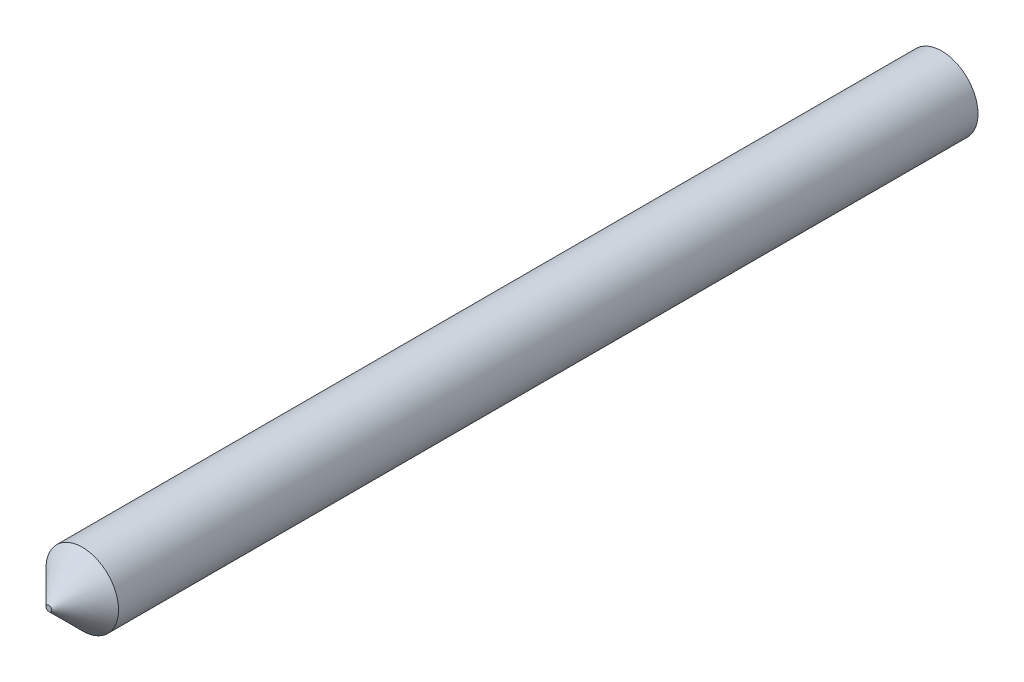
ISO-10303-21;
HEADER;
FILE_DESCRIPTION(('STEP AP214'),'2;1');
FILE_NAME('part.step','',(''),(''),'','','');
FILE_SCHEMA(('AUTOMOTIVE_DESIGN { 1 0 10303 214 1 1 1 1 }'));
ENDSEC;
DATA;
#1=APPLICATION_CONTEXT('core data for automotive mechanical design processes');
#2=APPLICATION_PROTOCOL_DEFINITION('international standard','automotive_design',2000,#1);
#3=PRODUCT_CONTEXT('',#1,'mechanical');
#4=PRODUCT('Part','Part','',(#3));
#5=PRODUCT_RELATED_PRODUCT_CATEGORY('part','',(#4));
#6=PRODUCT_DEFINITION_FORMATION('','',#4);
#7=PRODUCT_DEFINITION_CONTEXT('part definition',#1,'design');
#8=PRODUCT_DEFINITION('design','',#6,#7);
#9=PRODUCT_DEFINITION_SHAPE('','',#8);
#10=(LENGTH_UNIT() NAMED_UNIT(*) SI_UNIT(.MILLI.,.METRE.));
#11=(NAMED_UNIT(*) PLANE_ANGLE_UNIT() SI_UNIT($,.RADIAN.));
#12=(NAMED_UNIT(*) SI_UNIT($,.STERADIAN.) SOLID_ANGLE_UNIT());
#13=UNCERTAINTY_MEASURE_WITH_UNIT(LENGTH_MEASURE(1.E-05),#10,'distance_accuracy_value','');
#14=(GEOMETRIC_REPRESENTATION_CONTEXT(3) GLOBAL_UNCERTAINTY_ASSIGNED_CONTEXT((#13)) GLOBAL_UNIT_ASSIGNED_CONTEXT((#10,
#11,#12)) REPRESENTATION_CONTEXT('',''));
#15=CARTESIAN_POINT('',(0.,0.,0.));
#16=DIRECTION('',(0.,0.,1.));
#17=DIRECTION('',(1.,0.,0.));
#18=AXIS2_PLACEMENT_3D('',#15,#16,#17);
#19=CARTESIAN_POINT('',(0.,0.,40.));
#20=DIRECTION('',(0.,0.,-1.));
#21=DIRECTION('',(-1.,0.,0.));
#22=AXIS2_PLACEMENT_3D('',#19,#20,#21);
#23=CYLINDRICAL_SURFACE('',#22,1.625);
#24=CARTESIAN_POINT('',(0.,0.,38.5));
#25=DIRECTION('',(0.,0.,1.));
#26=DIRECTION('',(1.,0.,0.));
#27=AXIS2_PLACEMENT_3D('',#24,#25,#26);
#28=CIRCLE('',#27,1.625);
#29=CARTESIAN_POINT('',(1.625,0.,38.5));
#30=VERTEX_POINT('',#29);
#31=EDGE_CURVE('E10',#30,#30,#28,.F.);
#32=ORIENTED_EDGE('',*,*,#31,.T.);
#33=EDGE_LOOP('',(#32));
#34=FACE_BOUND('',#33,.T.);
#35=CARTESIAN_POINT('',(0.,0.,0.));
#36=DIRECTION('',(0.,0.,1.));
#37=DIRECTION('',(1.,0.,0.));
#38=AXIS2_PLACEMENT_3D('',#35,#36,#37);
#39=CIRCLE('',#38,1.625);
#40=CARTESIAN_POINT('',(1.625,0.,0.));
#41=VERTEX_POINT('',#40);
#42=EDGE_CURVE('E41',#41,#41,#39,.T.);
#43=ORIENTED_EDGE('',*,*,#42,.T.);
#44=EDGE_LOOP('',(#43));
#45=FACE_BOUND('',#44,.T.);
#46=ADVANCED_FACE('F30',(#34,#45),#23,.T.);
#47=CARTESIAN_POINT('',(0.,0.,40.));
#48=DIRECTION('',(0.,0.,1.));
#49=DIRECTION('',(1.,0.,0.));
#50=AXIS2_PLACEMENT_3D('',#47,#48,#49);
#51=PLANE('',#50);
#52=CARTESIAN_POINT('',(0.,0.,40.));
#53=DIRECTION('',(0.,0.,1.));
#54=DIRECTION('',(1.,0.,0.));
#55=AXIS2_PLACEMENT_3D('',#52,#53,#54);
#56=CIRCLE('',#55,0.124999999999993);
#57=CARTESIAN_POINT('',(0.124999999999993,0.,40.));
#58=VERTEX_POINT('',#57);
#59=EDGE_CURVE('E37',#58,#58,#56,.T.);
#60=ORIENTED_EDGE('',*,*,#59,.T.);
#61=EDGE_LOOP('',(#60));
#62=FACE_BOUND('',#61,.T.);
#63=ADVANCED_FACE('F51',(#62),#51,.T.);
#64=CARTESIAN_POINT('',(0.,0.,0.));
#65=DIRECTION('',(0.,0.,1.));
#66=DIRECTION('',(1.,0.,0.));
#67=AXIS2_PLACEMENT_3D('',#64,#65,#66);
#68=PLANE('',#67);
#69=ORIENTED_EDGE('',*,*,#42,.F.);
#70=EDGE_LOOP('',(#69));
#71=FACE_BOUND('',#70,.T.);
#72=ADVANCED_FACE('F49',(#71),#68,.F.);
#73=CARTESIAN_POINT('',(0.,0.,40.));
#74=DIRECTION('',(0.,0.,-1.));
#75=DIRECTION('',(-1.,0.,0.));
#76=AXIS2_PLACEMENT_3D('',#73,#74,#75);
#77=CONICAL_SURFACE('',#76,0.124999999999993,0.785398163397443);
#78=ORIENTED_EDGE('',*,*,#31,.F.);
#79=EDGE_LOOP('',(#78));
#80=FACE_BOUND('',#79,.T.);
#81=ORIENTED_EDGE('',*,*,#59,.F.);
#82=EDGE_LOOP('',(#81));
#83=FACE_BOUND('',#82,.T.);
#84=ADVANCED_FACE('F32',(#80,#83),#77,.T.);
#85=CLOSED_SHELL('',(#46,#63,#72,#84));
#86=MANIFOLD_SOLID_BREP('B2',#85);
#87=ADVANCED_BREP_SHAPE_REPRESENTATION('',(#18,#86),#14);
#88=SHAPE_DEFINITION_REPRESENTATION(#9,#87);
ENDSEC;
END-ISO-10303-21;
